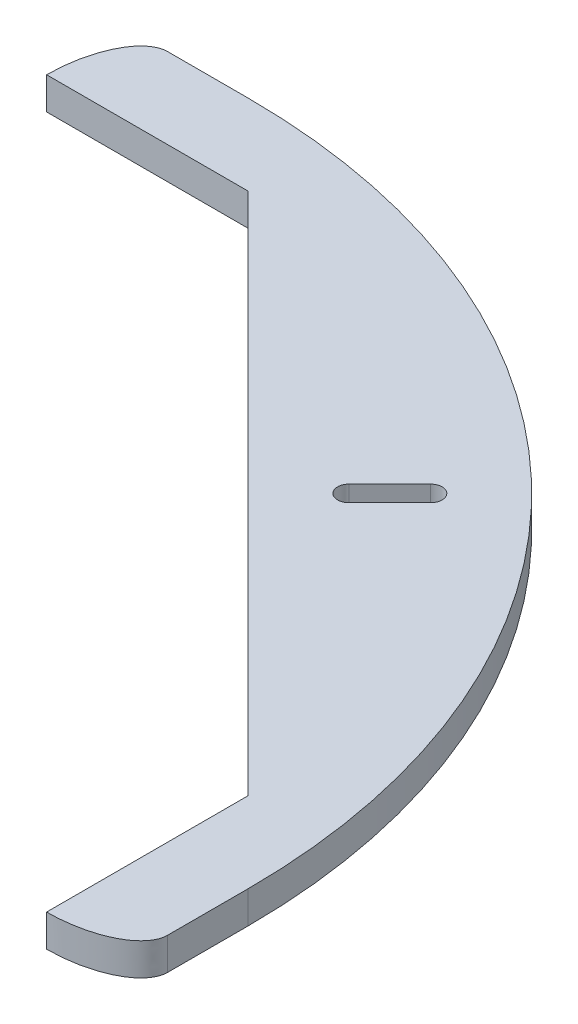
ISO-10303-21;
HEADER;
FILE_DESCRIPTION(('STEP AP214'),'2;1');
FILE_NAME('part.step','',(''),(''),'','','');
FILE_SCHEMA(('AUTOMOTIVE_DESIGN { 1 0 10303 214 1 1 1 1 }'));
ENDSEC;
DATA;
#1=APPLICATION_CONTEXT('core data for automotive mechanical design processes');
#2=APPLICATION_PROTOCOL_DEFINITION('international standard','automotive_design',2000,#1);
#3=PRODUCT_CONTEXT('',#1,'mechanical');
#4=PRODUCT('Part','Part','',(#3));
#5=PRODUCT_RELATED_PRODUCT_CATEGORY('part','',(#4));
#6=PRODUCT_DEFINITION_FORMATION('','',#4);
#7=PRODUCT_DEFINITION_CONTEXT('part definition',#1,'design');
#8=PRODUCT_DEFINITION('design','',#6,#7);
#9=PRODUCT_DEFINITION_SHAPE('','',#8);
#10=(LENGTH_UNIT() NAMED_UNIT(*) SI_UNIT(.MILLI.,.METRE.));
#11=(NAMED_UNIT(*) PLANE_ANGLE_UNIT() SI_UNIT($,.RADIAN.));
#12=(NAMED_UNIT(*) SI_UNIT($,.STERADIAN.) SOLID_ANGLE_UNIT());
#13=UNCERTAINTY_MEASURE_WITH_UNIT(LENGTH_MEASURE(1.E-05),#10,'distance_accuracy_value','');
#14=(GEOMETRIC_REPRESENTATION_CONTEXT(3) GLOBAL_UNCERTAINTY_ASSIGNED_CONTEXT((#13)) GLOBAL_UNIT_ASSIGNED_CONTEXT((#10,
#11,#12)) REPRESENTATION_CONTEXT('',''));
#15=CARTESIAN_POINT('',(0.,0.,0.));
#16=DIRECTION('',(0.,0.,1.));
#17=DIRECTION('',(1.,0.,0.));
#18=AXIS2_PLACEMENT_3D('',#15,#16,#17);
#19=CARTESIAN_POINT('',(12.7,5.08,-12.6999999999999));
#20=DIRECTION('',(0.,-1.,0.));
#21=DIRECTION('',(0.,0.,-1.));
#22=AXIS2_PLACEMENT_3D('',#19,#20,#21);
#23=PLANE('',#22);
#24=DIRECTION('',(0.,0.,1.));
#25=VECTOR('',#24,1.);
#26=CARTESIAN_POINT('',(107.95,5.08,-25.4));
#27=LINE('',#26,#25);
#28=CARTESIAN_POINT('',(107.95,5.08,-25.4));
#29=VERTEX_POINT('',#28);
#30=CARTESIAN_POINT('',(107.95,5.08,6.35000000000012));
#31=VERTEX_POINT('',#30);
#32=EDGE_CURVE('E133',#29,#31,#27,.T.);
#33=ORIENTED_EDGE('',*,*,#32,.T.);
#34=CARTESIAN_POINT('',(120.65,5.08,1.19848575508286E-13));
#35=CARTESIAN_POINT('',(120.65,5.08,6.35000000000015));
#36=CARTESIAN_POINT('',(107.95,5.08,6.35000000000012));
#37=(BOUNDED_CURVE() B_SPLINE_CURVE(2,(#34,#35,#36),.UNSPECIFIED.,.F.,
.F.) B_SPLINE_CURVE_WITH_KNOTS((3,3),(0.,1.),
.UNSPECIFIED.) CURVE() GEOMETRIC_REPRESENTATION_ITEM() RATIONAL_B_SPLINE_CURVE((1.,
0.707106781186547,1.)) REPRESENTATION_ITEM(''));
#38=CARTESIAN_POINT('',(120.65,5.08,1.19848575508286E-13));
#39=VERTEX_POINT('',#38);
#40=EDGE_CURVE('E12',#31,#39,#37,.F.);
#41=ORIENTED_EDGE('',*,*,#40,.T.);
#42=DIRECTION('',(0.,0.,-1.));
#43=VECTOR('',#42,1.);
#44=CARTESIAN_POINT('',(120.65,5.08,0.));
#45=LINE('',#44,#43);
#46=CARTESIAN_POINT('',(120.65,5.08,-12.7));
#47=VERTEX_POINT('',#46);
#48=EDGE_CURVE('E141',#39,#47,#45,.T.);
#49=ORIENTED_EDGE('',*,*,#48,.T.);
#50=CARTESIAN_POINT('',(12.7,5.08,-12.6999999999999));
#51=DIRECTION('',(0.,1.,0.));
#52=DIRECTION('',(0.,0.,-1.));
#53=AXIS2_PLACEMENT_3D('',#50,#51,#52);
#54=CIRCLE('',#53,107.95);
#55=CARTESIAN_POINT('',(12.7,5.08,-120.65));
#56=VERTEX_POINT('',#55);
#57=EDGE_CURVE('E365',#47,#56,#54,.T.);
#58=ORIENTED_EDGE('',*,*,#57,.T.);
#59=DIRECTION('',(-1.,0.,0.));
#60=VECTOR('',#59,1.);
#61=CARTESIAN_POINT('',(0.,5.08,-120.65));
#62=LINE('',#61,#60);
#63=CARTESIAN_POINT('',(0.,5.08,-120.65));
#64=VERTEX_POINT('',#63);
#65=EDGE_CURVE('E362',#56,#64,#62,.T.);
#66=ORIENTED_EDGE('',*,*,#65,.T.);
#67=CARTESIAN_POINT('',(-6.35,5.08,-107.95));
#68=CARTESIAN_POINT('',(-6.35,5.08,-120.65));
#69=CARTESIAN_POINT('',(0.,5.08,-120.65));
#70=(BOUNDED_CURVE() B_SPLINE_CURVE(2,(#67,#68,#69),.UNSPECIFIED.,.F.,
.F.) B_SPLINE_CURVE_WITH_KNOTS((3,3),(0.,1.),
.UNSPECIFIED.) CURVE() GEOMETRIC_REPRESENTATION_ITEM() RATIONAL_B_SPLINE_CURVE((1.,
0.707106781186548,1.)) REPRESENTATION_ITEM(''));
#71=CARTESIAN_POINT('',(-6.35,5.08,-107.95));
#72=VERTEX_POINT('',#71);
#73=EDGE_CURVE('E487',#64,#72,#70,.F.);
#74=ORIENTED_EDGE('',*,*,#73,.T.);
#75=DIRECTION('',(1.,0.,0.));
#76=VECTOR('',#75,1.);
#77=CARTESIAN_POINT('',(0.,5.08,-107.95));
#78=LINE('',#77,#76);
#79=CARTESIAN_POINT('',(25.4,5.08,-107.95));
#80=VERTEX_POINT('',#79);
#81=EDGE_CURVE('E213',#72,#80,#78,.T.);
#82=ORIENTED_EDGE('',*,*,#81,.T.);
#83=DIRECTION('',(0.707106781186547,0.,0.707106781186547));
#84=VECTOR('',#83,1.);
#85=CARTESIAN_POINT('',(25.4,5.08,-107.95));
#86=LINE('',#85,#84);
#87=EDGE_CURVE('E137',#80,#29,#86,.T.);
#88=ORIENTED_EDGE('',*,*,#87,.T.);
#89=EDGE_LOOP('',(#33,#41,#49,#58,#66,#74,#82,#88));
#90=FACE_BOUND('',#89,.T.);
#91=CARTESIAN_POINT('',(74.6362526601451,5.08,-74.6362526601451));
#92=DIRECTION('',(0.,1.,0.));
#93=DIRECTION('',(0.,0.,1.));
#94=AXIS2_PLACEMENT_3D('',#91,#92,#93);
#95=CIRCLE('',#94,1.79999999999998);
#96=CARTESIAN_POINT('',(73.3634604540094,5.08,-75.9090448662809));
#97=VERTEX_POINT('',#96);
#98=CARTESIAN_POINT('',(75.9090448662809,5.08,-73.3634604540094));
#99=VERTEX_POINT('',#98);
#100=EDGE_CURVE('E384',#97,#99,#95,.T.);
#101=ORIENTED_EDGE('',*,*,#100,.F.);
#102=DIRECTION('',(-0.707106781186548,0.,0.707106781186548));
#103=VECTOR('',#102,1.);
#104=CARTESIAN_POINT('',(73.3634604540094,5.08,-75.9090448662809));
#105=LINE('',#104,#103);
#106=CARTESIAN_POINT('',(79.7981321628069,5.08,-82.3437165750784));
#107=VERTEX_POINT('',#106);
#108=EDGE_CURVE('E380',#107,#97,#105,.T.);
#109=ORIENTED_EDGE('',*,*,#108,.F.);
#110=CARTESIAN_POINT('',(81.0709243689427,5.08,-81.0709243689427));
#111=DIRECTION('',(0.,1.,0.));
#112=DIRECTION('',(0.,0.,1.));
#113=AXIS2_PLACEMENT_3D('',#110,#111,#112);
#114=CIRCLE('',#113,1.79999999999998);
#115=CARTESIAN_POINT('',(82.3437165750784,5.08,-79.7981321628069));
#116=VERTEX_POINT('',#115);
#117=EDGE_CURVE('E395',#116,#107,#114,.T.);
#118=ORIENTED_EDGE('',*,*,#117,.F.);
#119=DIRECTION('',(0.707106781186548,0.,-0.707106781186548));
#120=VECTOR('',#119,1.);
#121=CARTESIAN_POINT('',(75.9090448662809,5.08,-73.3634604540094));
#122=LINE('',#121,#120);
#123=EDGE_CURVE('E398',#99,#116,#122,.T.);
#124=ORIENTED_EDGE('',*,*,#123,.F.);
#125=EDGE_LOOP('',(#101,#109,#118,#124));
#126=FACE_BOUND('',#125,.T.);
#127=ADVANCED_FACE('F39',(#90,#126),#23,.F.);
#128=CARTESIAN_POINT('',(12.7,0.,-12.6999999999999));
#129=DIRECTION('',(0.,-1.,0.));
#130=DIRECTION('',(0.,0.,-1.));
#131=AXIS2_PLACEMENT_3D('',#128,#129,#130);
#132=PLANE('',#131);
#133=DIRECTION('',(0.,0.,-1.));
#134=VECTOR('',#133,1.);
#135=CARTESIAN_POINT('',(120.65,0.,0.));
#136=LINE('',#135,#134);
#137=CARTESIAN_POINT('',(120.65,0.,1.19848575508286E-13));
#138=VERTEX_POINT('',#137);
#139=CARTESIAN_POINT('',(120.65,0.,-12.7));
#140=VERTEX_POINT('',#139);
#141=EDGE_CURVE('E319',#138,#140,#136,.T.);
#142=ORIENTED_EDGE('',*,*,#141,.F.);
#143=CARTESIAN_POINT('',(107.95,0.,6.35000000000012));
#144=CARTESIAN_POINT('',(120.65,0.,6.35000000000015));
#145=CARTESIAN_POINT('',(120.65,0.,1.19848575508286E-13));
#146=(BOUNDED_CURVE() B_SPLINE_CURVE(2,(#143,#144,#145),.UNSPECIFIED.,.F.,
.F.) B_SPLINE_CURVE_WITH_KNOTS((3,3),(0.,1.),
.UNSPECIFIED.) CURVE() GEOMETRIC_REPRESENTATION_ITEM() RATIONAL_B_SPLINE_CURVE((1.,
0.707106781186547,1.)) REPRESENTATION_ITEM(''));
#147=CARTESIAN_POINT('',(107.95,0.,6.35000000000012));
#148=VERTEX_POINT('',#147);
#149=EDGE_CURVE('E54',#138,#148,#146,.F.);
#150=ORIENTED_EDGE('',*,*,#149,.T.);
#151=DIRECTION('',(0.,0.,1.));
#152=VECTOR('',#151,1.);
#153=CARTESIAN_POINT('',(107.95,0.,-25.4));
#154=LINE('',#153,#152);
#155=CARTESIAN_POINT('',(107.95,0.,-25.4));
#156=VERTEX_POINT('',#155);
#157=EDGE_CURVE('E147',#156,#148,#154,.T.);
#158=ORIENTED_EDGE('',*,*,#157,.F.);
#159=DIRECTION('',(0.707106781186547,0.,0.707106781186547));
#160=VECTOR('',#159,1.);
#161=CARTESIAN_POINT('',(25.4,0.,-107.95));
#162=LINE('',#161,#160);
#163=CARTESIAN_POINT('',(25.4,0.,-107.95));
#164=VERTEX_POINT('',#163);
#165=EDGE_CURVE('E333',#164,#156,#162,.T.);
#166=ORIENTED_EDGE('',*,*,#165,.F.);
#167=DIRECTION('',(1.,0.,0.));
#168=VECTOR('',#167,1.);
#169=CARTESIAN_POINT('',(0.,0.,-107.95));
#170=LINE('',#169,#168);
#171=CARTESIAN_POINT('',(-6.35,0.,-107.95));
#172=VERTEX_POINT('',#171);
#173=EDGE_CURVE('E352',#172,#164,#170,.T.);
#174=ORIENTED_EDGE('',*,*,#173,.F.);
#175=CARTESIAN_POINT('',(0.,0.,-120.65));
#176=CARTESIAN_POINT('',(-6.35,0.,-120.65));
#177=CARTESIAN_POINT('',(-6.35,0.,-107.95));
#178=(BOUNDED_CURVE() B_SPLINE_CURVE(2,(#175,#176,#177),.UNSPECIFIED.,.F.,
.F.) B_SPLINE_CURVE_WITH_KNOTS((3,3),(0.,1.),
.UNSPECIFIED.) CURVE() GEOMETRIC_REPRESENTATION_ITEM() RATIONAL_B_SPLINE_CURVE((1.,
0.707106781186548,1.)) REPRESENTATION_ITEM(''));
#179=CARTESIAN_POINT('',(0.,0.,-120.65));
#180=VERTEX_POINT('',#179);
#181=EDGE_CURVE('E227',#172,#180,#178,.F.);
#182=ORIENTED_EDGE('',*,*,#181,.T.);
#183=DIRECTION('',(-1.,0.,0.));
#184=VECTOR('',#183,1.);
#185=CARTESIAN_POINT('',(0.,0.,-120.65));
#186=LINE('',#185,#184);
#187=CARTESIAN_POINT('',(12.7,0.,-120.65));
#188=VERTEX_POINT('',#187);
#189=EDGE_CURVE('E220',#188,#180,#186,.T.);
#190=ORIENTED_EDGE('',*,*,#189,.F.);
#191=CARTESIAN_POINT('',(12.7,0.,-12.6999999999999));
#192=DIRECTION('',(0.,1.,0.));
#193=DIRECTION('',(0.,0.,-1.));
#194=AXIS2_PLACEMENT_3D('',#191,#192,#193);
#195=CIRCLE('',#194,107.95);
#196=EDGE_CURVE('E327',#140,#188,#195,.T.);
#197=ORIENTED_EDGE('',*,*,#196,.F.);
#198=EDGE_LOOP('',(#142,#150,#158,#166,#174,#182,#190,#197));
#199=FACE_BOUND('',#198,.T.);
#200=DIRECTION('',(-0.707106781186548,0.,0.707106781186548));
#201=VECTOR('',#200,1.);
#202=CARTESIAN_POINT('',(73.3634604540094,0.,-75.9090448662809));
#203=LINE('',#202,#201);
#204=CARTESIAN_POINT('',(79.7981321628069,0.,-82.3437165750784));
#205=VERTEX_POINT('',#204);
#206=CARTESIAN_POINT('',(73.3634604540094,0.,-75.9090448662809));
#207=VERTEX_POINT('',#206);
#208=EDGE_CURVE('E381',#205,#207,#203,.T.);
#209=ORIENTED_EDGE('',*,*,#208,.T.);
#210=CARTESIAN_POINT('',(74.6362526601451,0.,-74.6362526601451));
#211=DIRECTION('',(0.,1.,0.));
#212=DIRECTION('',(0.,0.,1.));
#213=AXIS2_PLACEMENT_3D('',#210,#211,#212);
#214=CIRCLE('',#213,1.79999999999998);
#215=CARTESIAN_POINT('',(75.9090448662809,0.,-73.3634604540094));
#216=VERTEX_POINT('',#215);
#217=EDGE_CURVE('E391',#207,#216,#214,.T.);
#218=ORIENTED_EDGE('',*,*,#217,.T.);
#219=DIRECTION('',(0.707106781186548,0.,-0.707106781186548));
#220=VECTOR('',#219,1.);
#221=CARTESIAN_POINT('',(75.9090448662809,0.,-73.3634604540094));
#222=LINE('',#221,#220);
#223=CARTESIAN_POINT('',(82.3437165750784,0.,-79.7981321628069));
#224=VERTEX_POINT('',#223);
#225=EDGE_CURVE('E388',#216,#224,#222,.T.);
#226=ORIENTED_EDGE('',*,*,#225,.T.);
#227=CARTESIAN_POINT('',(81.0709243689427,0.,-81.0709243689427));
#228=DIRECTION('',(0.,1.,0.));
#229=DIRECTION('',(0.,0.,1.));
#230=AXIS2_PLACEMENT_3D('',#227,#228,#229);
#231=CIRCLE('',#230,1.79999999999998);
#232=EDGE_CURVE('E385',#224,#205,#231,.T.);
#233=ORIENTED_EDGE('',*,*,#232,.T.);
#234=EDGE_LOOP('',(#209,#218,#226,#233));
#235=FACE_BOUND('',#234,.T.);
#236=ADVANCED_FACE('F201',(#199,#235),#132,.T.);
#237=CARTESIAN_POINT('',(0.,5.08,-107.95));
#238=DIRECTION('',(0.,0.,-1.));
#239=DIRECTION('',(-1.,0.,0.));
#240=AXIS2_PLACEMENT_3D('',#237,#238,#239);
#241=PLANE('',#240);
#242=ORIENTED_EDGE('',*,*,#173,.T.);
#243=DIRECTION('',(0.,-1.,0.));
#244=VECTOR('',#243,1.);
#245=CARTESIAN_POINT('',(25.4,5.08,-107.95));
#246=LINE('',#245,#244);
#247=EDGE_CURVE('E344',#80,#164,#246,.T.);
#248=ORIENTED_EDGE('',*,*,#247,.F.);
#249=ORIENTED_EDGE('',*,*,#81,.F.);
#250=CARTESIAN_POINT('',(-6.35,-0.254,-107.95));
#251=CARTESIAN_POINT('',(-6.35,1.60866666666667,-107.95));
#252=CARTESIAN_POINT('',(-6.35,3.47133333333333,-107.95));
#253=CARTESIAN_POINT('',(-6.35,5.334,-107.95));
#254=(BOUNDED_CURVE() B_SPLINE_CURVE(3,(#250,#251,#252,#253),.UNSPECIFIED.,.F.,
.F.) B_SPLINE_CURVE_WITH_KNOTS((4,4),(-0.000254,0.005334),
.UNSPECIFIED.) CURVE() GEOMETRIC_REPRESENTATION_ITEM() RATIONAL_B_SPLINE_CURVE((1.,1.,1.,1.)) REPRESENTATION_ITEM(''));
#255=EDGE_CURVE('E149',#172,#72,#254,.T.);
#256=ORIENTED_EDGE('',*,*,#255,.F.);
#257=EDGE_LOOP('',(#242,#248,#249,#256));
#258=FACE_BOUND('',#257,.T.);
#259=ADVANCED_FACE('F248',(#258),#241,.F.);
#260=CARTESIAN_POINT('',(25.4,5.08,-107.95));
#261=DIRECTION('',(0.707106781186548,0.,-0.707106781186547));
#262=DIRECTION('',(-0.707106781186547,0.,-0.707106781186548));
#263=AXIS2_PLACEMENT_3D('',#260,#261,#262);
#264=PLANE('',#263);
#265=ORIENTED_EDGE('',*,*,#165,.T.);
#266=DIRECTION('',(0.,-1.,0.));
#267=VECTOR('',#266,1.);
#268=CARTESIAN_POINT('',(107.95,5.08,-25.4));
#269=LINE('',#268,#267);
#270=EDGE_CURVE('E475',#29,#156,#269,.T.);
#271=ORIENTED_EDGE('',*,*,#270,.F.);
#272=ORIENTED_EDGE('',*,*,#87,.F.);
#273=ORIENTED_EDGE('',*,*,#247,.T.);
#274=EDGE_LOOP('',(#265,#271,#272,#273));
#275=FACE_BOUND('',#274,.T.);
#276=ADVANCED_FACE('F474',(#275),#264,.F.);
#277=CARTESIAN_POINT('',(107.95,5.08,-25.4));
#278=DIRECTION('',(1.,0.,0.));
#279=DIRECTION('',(0.,0.,-1.));
#280=AXIS2_PLACEMENT_3D('',#277,#278,#279);
#281=PLANE('',#280);
#282=ORIENTED_EDGE('',*,*,#157,.T.);
#283=CARTESIAN_POINT('',(107.95,5.334,6.35000000000012));
#284=CARTESIAN_POINT('',(107.95,3.47133333333333,6.35000000000012));
#285=CARTESIAN_POINT('',(107.95,1.60866666666667,6.35000000000012));
#286=CARTESIAN_POINT('',(107.95,-0.254,6.35000000000012));
#287=(BOUNDED_CURVE() B_SPLINE_CURVE(3,(#283,#284,#285,#286),.UNSPECIFIED.,.F.,
.F.) B_SPLINE_CURVE_WITH_KNOTS((4,4),(-0.005334,0.000254),
.UNSPECIFIED.) CURVE() GEOMETRIC_REPRESENTATION_ITEM() RATIONAL_B_SPLINE_CURVE((1.,1.,1.,1.)) REPRESENTATION_ITEM(''));
#288=EDGE_CURVE('E144',#148,#31,#287,.F.);
#289=ORIENTED_EDGE('',*,*,#288,.T.);
#290=ORIENTED_EDGE('',*,*,#32,.F.);
#291=ORIENTED_EDGE('',*,*,#270,.T.);
#292=EDGE_LOOP('',(#282,#289,#290,#291));
#293=FACE_BOUND('',#292,.T.);
#294=ADVANCED_FACE('F145',(#293),#281,.F.);
#295=CARTESIAN_POINT('',(120.65,5.08,0.));
#296=DIRECTION('',(-1.,0.,0.));
#297=DIRECTION('',(0.,0.,1.));
#298=AXIS2_PLACEMENT_3D('',#295,#296,#297);
#299=PLANE('',#298);
#300=ORIENTED_EDGE('',*,*,#48,.F.);
#301=CARTESIAN_POINT('',(120.65,-0.254,1.19848575508286E-13));
#302=CARTESIAN_POINT('',(120.65,1.60866666666667,1.19848575508286E-13));
#303=CARTESIAN_POINT('',(120.65,3.47133333333333,1.19848575508286E-13));
#304=CARTESIAN_POINT('',(120.65,5.334,1.19848575508286E-13));
#305=(BOUNDED_CURVE() B_SPLINE_CURVE(3,(#301,#302,#303,#304),.UNSPECIFIED.,.F.,
.F.) B_SPLINE_CURVE_WITH_KNOTS((4,4),(-0.005334,0.000254),
.UNSPECIFIED.) CURVE() GEOMETRIC_REPRESENTATION_ITEM() RATIONAL_B_SPLINE_CURVE((1.,1.,1.,1.)) REPRESENTATION_ITEM(''));
#306=EDGE_CURVE('E152',#39,#138,#305,.F.);
#307=ORIENTED_EDGE('',*,*,#306,.T.);
#308=ORIENTED_EDGE('',*,*,#141,.T.);
#309=DIRECTION('',(0.,-1.,0.));
#310=VECTOR('',#309,1.);
#311=CARTESIAN_POINT('',(120.65,5.08,-12.7));
#312=LINE('',#311,#310);
#313=EDGE_CURVE('E477',#47,#140,#312,.T.);
#314=ORIENTED_EDGE('',*,*,#313,.F.);
#315=EDGE_LOOP('',(#300,#307,#308,#314));
#316=FACE_BOUND('',#315,.T.);
#317=ADVANCED_FACE('F435',(#316),#299,.F.);
#318=CARTESIAN_POINT('',(12.7,5.08,-12.6999999999999));
#319=DIRECTION('',(0.,-1.,0.));
#320=DIRECTION('',(0.,0.,-1.));
#321=AXIS2_PLACEMENT_3D('',#318,#319,#320);
#322=CYLINDRICAL_SURFACE('',#321,107.95);
#323=ORIENTED_EDGE('',*,*,#196,.T.);
#324=DIRECTION('',(0.,-1.,0.));
#325=VECTOR('',#324,1.);
#326=CARTESIAN_POINT('',(12.7,5.08,-120.65));
#327=LINE('',#326,#325);
#328=EDGE_CURVE('E338',#56,#188,#327,.T.);
#329=ORIENTED_EDGE('',*,*,#328,.F.);
#330=ORIENTED_EDGE('',*,*,#57,.F.);
#331=ORIENTED_EDGE('',*,*,#313,.T.);
#332=EDGE_LOOP('',(#323,#329,#330,#331));
#333=FACE_BOUND('',#332,.T.);
#334=ADVANCED_FACE('F430',(#333),#322,.T.);
#335=CARTESIAN_POINT('',(0.,5.08,-120.65));
#336=DIRECTION('',(0.,0.,1.));
#337=DIRECTION('',(1.,0.,0.));
#338=AXIS2_PLACEMENT_3D('',#335,#336,#337);
#339=PLANE('',#338);
#340=ORIENTED_EDGE('',*,*,#189,.T.);
#341=CARTESIAN_POINT('',(0.,5.334,-120.65));
#342=CARTESIAN_POINT('',(0.,3.47133333333333,-120.65));
#343=CARTESIAN_POINT('',(0.,1.60866666666667,-120.65));
#344=CARTESIAN_POINT('',(0.,-0.254,-120.65));
#345=(BOUNDED_CURVE() B_SPLINE_CURVE(3,(#341,#342,#343,#344),.UNSPECIFIED.,.F.,
.F.) B_SPLINE_CURVE_WITH_KNOTS((4,4),(-0.000254,0.005334),
.UNSPECIFIED.) CURVE() GEOMETRIC_REPRESENTATION_ITEM() RATIONAL_B_SPLINE_CURVE((1.,1.,1.,1.)) REPRESENTATION_ITEM(''));
#346=EDGE_CURVE('E486',#180,#64,#345,.F.);
#347=ORIENTED_EDGE('',*,*,#346,.T.);
#348=ORIENTED_EDGE('',*,*,#65,.F.);
#349=ORIENTED_EDGE('',*,*,#328,.T.);
#350=EDGE_LOOP('',(#340,#347,#348,#349));
#351=FACE_BOUND('',#350,.T.);
#352=ADVANCED_FACE('F426',(#351),#339,.F.);
#353=CARTESIAN_POINT('',(74.6362526601451,5.08,-74.6362526601451));
#354=DIRECTION('',(0.,-1.,0.));
#355=DIRECTION('',(0.,0.,-1.));
#356=AXIS2_PLACEMENT_3D('',#353,#354,#355);
#357=CYLINDRICAL_SURFACE('',#356,1.79999999999998);
#358=ORIENTED_EDGE('',*,*,#217,.F.);
#359=DIRECTION('',(0.,-1.,0.));
#360=VECTOR('',#359,1.);
#361=CARTESIAN_POINT('',(73.3634604540094,5.08,-75.9090448662809));
#362=LINE('',#361,#360);
#363=EDGE_CURVE('E377',#97,#207,#362,.T.);
#364=ORIENTED_EDGE('',*,*,#363,.F.);
#365=ORIENTED_EDGE('',*,*,#100,.T.);
#366=DIRECTION('',(0.,-1.,0.));
#367=VECTOR('',#366,1.);
#368=CARTESIAN_POINT('',(75.9090448662809,5.08,-73.3634604540094));
#369=LINE('',#368,#367);
#370=EDGE_CURVE('E359',#99,#216,#369,.T.);
#371=ORIENTED_EDGE('',*,*,#370,.T.);
#372=EDGE_LOOP('',(#358,#364,#365,#371));
#373=FACE_BOUND('',#372,.T.);
#374=ADVANCED_FACE('F202',(#373),#357,.F.);
#375=CARTESIAN_POINT('',(75.9090448662809,5.08,-73.3634604540094));
#376=DIRECTION('',(-0.707106781186548,0.,-0.707106781186548));
#377=DIRECTION('',(-0.707106781186548,0.,0.707106781186548));
#378=AXIS2_PLACEMENT_3D('',#375,#376,#377);
#379=PLANE('',#378);
#380=ORIENTED_EDGE('',*,*,#225,.F.);
#381=ORIENTED_EDGE('',*,*,#370,.F.);
#382=ORIENTED_EDGE('',*,*,#123,.T.);
#383=DIRECTION('',(0.,-1.,0.));
#384=VECTOR('',#383,1.);
#385=CARTESIAN_POINT('',(82.3437165750784,5.08,-79.7981321628069));
#386=LINE('',#385,#384);
#387=EDGE_CURVE('E373',#116,#224,#386,.T.);
#388=ORIENTED_EDGE('',*,*,#387,.T.);
#389=EDGE_LOOP('',(#380,#381,#382,#388));
#390=FACE_BOUND('',#389,.T.);
#391=ADVANCED_FACE('F407',(#390),#379,.T.);
#392=CARTESIAN_POINT('',(81.0709243689427,5.08,-81.0709243689427));
#393=DIRECTION('',(0.,-1.,0.));
#394=DIRECTION('',(0.,0.,-1.));
#395=AXIS2_PLACEMENT_3D('',#392,#393,#394);
#396=CYLINDRICAL_SURFACE('',#395,1.79999999999998);
#397=ORIENTED_EDGE('',*,*,#232,.F.);
#398=ORIENTED_EDGE('',*,*,#387,.F.);
#399=ORIENTED_EDGE('',*,*,#117,.T.);
#400=DIRECTION('',(0.,-1.,0.));
#401=VECTOR('',#400,1.);
#402=CARTESIAN_POINT('',(79.7981321628069,5.08,-82.3437165750784));
#403=LINE('',#402,#401);
#404=EDGE_CURVE('E375',#107,#205,#403,.T.);
#405=ORIENTED_EDGE('',*,*,#404,.T.);
#406=EDGE_LOOP('',(#397,#398,#399,#405));
#407=FACE_BOUND('',#406,.T.);
#408=ADVANCED_FACE('F412',(#407),#396,.F.);
#409=CARTESIAN_POINT('',(73.3634604540094,5.08,-75.9090448662809));
#410=DIRECTION('',(0.707106781186548,0.,0.707106781186548));
#411=DIRECTION('',(0.707106781186548,0.,-0.707106781186548));
#412=AXIS2_PLACEMENT_3D('',#409,#410,#411);
#413=PLANE('',#412);
#414=ORIENTED_EDGE('',*,*,#208,.F.);
#415=ORIENTED_EDGE('',*,*,#404,.F.);
#416=ORIENTED_EDGE('',*,*,#108,.T.);
#417=ORIENTED_EDGE('',*,*,#363,.T.);
#418=EDGE_LOOP('',(#414,#415,#416,#417));
#419=FACE_BOUND('',#418,.T.);
#420=ADVANCED_FACE('F247',(#419),#413,.T.);
#421=CARTESIAN_POINT('',(0.,-0.254,-120.65));
#422=CARTESIAN_POINT('',(0.,1.60866666666667,-120.65));
#423=CARTESIAN_POINT('',(0.,3.47133333333333,-120.65));
#424=CARTESIAN_POINT('',(0.,5.334,-120.65));
#425=CARTESIAN_POINT('',(-6.35,-0.254,-120.65));
#426=CARTESIAN_POINT('',(-6.35,1.60866666666667,-120.65));
#427=CARTESIAN_POINT('',(-6.35,3.47133333333333,-120.65));
#428=CARTESIAN_POINT('',(-6.35,5.334,-120.65));
#429=CARTESIAN_POINT('',(-6.35,-0.254,-107.95));
#430=CARTESIAN_POINT('',(-6.35,1.60866666666667,-107.95));
#431=CARTESIAN_POINT('',(-6.35,3.47133333333333,-107.95));
#432=CARTESIAN_POINT('',(-6.35,5.334,-107.95));
#433=(BOUNDED_SURFACE() B_SPLINE_SURFACE(2,3,((#421,#422,#423,#424),(#425,#426,#427,#428),(#429,
#430,#431,#432)),.UNSPECIFIED.,.F.,.F.,.F.) B_SPLINE_SURFACE_WITH_KNOTS((3,3),(4,4),(0.,1.),
(-0.000254,0.005334),
.UNSPECIFIED.) GEOMETRIC_REPRESENTATION_ITEM() RATIONAL_B_SPLINE_SURFACE(((1.,1.,1.,1.),
(0.707106781186548,0.707106781186548,0.707106781186548,0.707106781186548),(1.,1.,1.,1.))) REPRESENTATION_ITEM('') SURFACE());
#434=ORIENTED_EDGE('',*,*,#73,.F.);
#435=ORIENTED_EDGE('',*,*,#346,.F.);
#436=ORIENTED_EDGE('',*,*,#181,.F.);
#437=ORIENTED_EDGE('',*,*,#255,.T.);
#438=EDGE_LOOP('',(#434,#435,#436,#437));
#439=FACE_BOUND('',#438,.T.);
#440=ADVANCED_FACE('F234',(#439),#433,.T.);
#441=CARTESIAN_POINT('',(107.95,-0.254,6.35000000000012));
#442=CARTESIAN_POINT('',(107.95,1.60866666666667,6.35000000000012));
#443=CARTESIAN_POINT('',(107.95,3.47133333333333,6.35000000000012));
#444=CARTESIAN_POINT('',(107.95,5.334,6.35000000000012));
#445=CARTESIAN_POINT('',(120.65,-0.254,6.35000000000015));
#446=CARTESIAN_POINT('',(120.65,1.60866666666667,6.35000000000015));
#447=CARTESIAN_POINT('',(120.65,3.47133333333334,6.35000000000015));
#448=CARTESIAN_POINT('',(120.65,5.334,6.35000000000015));
#449=CARTESIAN_POINT('',(120.65,-0.254,1.19848575508286E-13));
#450=CARTESIAN_POINT('',(120.65,1.60866666666667,1.19848575508286E-13));
#451=CARTESIAN_POINT('',(120.65,3.47133333333333,1.19848575508286E-13));
#452=CARTESIAN_POINT('',(120.65,5.334,1.19848575508286E-13));
#453=(BOUNDED_SURFACE() B_SPLINE_SURFACE(2,3,((#441,#442,#443,#444),(#445,#446,#447,#448),(#449,
#450,#451,#452)),.UNSPECIFIED.,.F.,.F.,.F.) B_SPLINE_SURFACE_WITH_KNOTS((3,3),(4,4),(0.,1.),
(-0.005334,0.000254),
.UNSPECIFIED.) GEOMETRIC_REPRESENTATION_ITEM() RATIONAL_B_SPLINE_SURFACE(((1.,1.,1.,1.),
(0.707106781186547,0.707106781186547,0.707106781186547,0.707106781186547),(1.,1.,1.,1.))) REPRESENTATION_ITEM('') SURFACE());
#454=ORIENTED_EDGE('',*,*,#40,.F.);
#455=ORIENTED_EDGE('',*,*,#288,.F.);
#456=ORIENTED_EDGE('',*,*,#149,.F.);
#457=ORIENTED_EDGE('',*,*,#306,.F.);
#458=EDGE_LOOP('',(#454,#455,#456,#457));
#459=FACE_BOUND('',#458,.T.);
#460=ADVANCED_FACE('F42',(#459),#453,.T.);
#461=CLOSED_SHELL('',(#127,#236,#259,#276,#294,#317,#334,#352,#374,#391,#408,#420,#440,#460));
#462=MANIFOLD_SOLID_BREP('B2',#461);
#463=ADVANCED_BREP_SHAPE_REPRESENTATION('',(#18,#462),#14);
#464=SHAPE_DEFINITION_REPRESENTATION(#9,#463);
ENDSEC;
END-ISO-10303-21;
